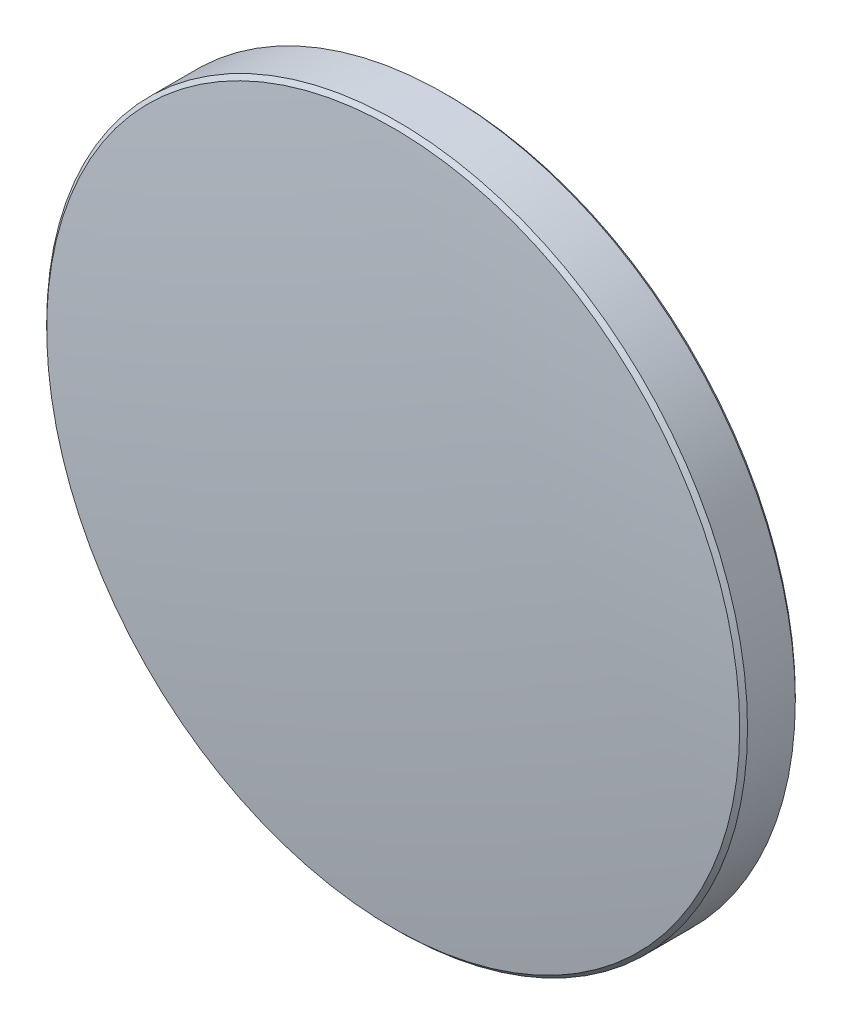
ISO-10303-21;
HEADER;
FILE_DESCRIPTION(('STEP AP214'),'2;1');
FILE_NAME('part.step','',(''),(''),'','','');
FILE_SCHEMA(('AUTOMOTIVE_DESIGN { 1 0 10303 214 1 1 1 1 }'));
ENDSEC;
DATA;
#1=APPLICATION_CONTEXT('core data for automotive mechanical design processes');
#2=APPLICATION_PROTOCOL_DEFINITION('international standard','automotive_design',2000,#1);
#3=PRODUCT_CONTEXT('',#1,'mechanical');
#4=PRODUCT('Part','Part','',(#3));
#5=PRODUCT_RELATED_PRODUCT_CATEGORY('part','',(#4));
#6=PRODUCT_DEFINITION_FORMATION('','',#4);
#7=PRODUCT_DEFINITION_CONTEXT('part definition',#1,'design');
#8=PRODUCT_DEFINITION('design','',#6,#7);
#9=PRODUCT_DEFINITION_SHAPE('','',#8);
#10=(LENGTH_UNIT() NAMED_UNIT(*) SI_UNIT(.MILLI.,.METRE.));
#11=(NAMED_UNIT(*) PLANE_ANGLE_UNIT() SI_UNIT($,.RADIAN.));
#12=(NAMED_UNIT(*) SI_UNIT($,.STERADIAN.) SOLID_ANGLE_UNIT());
#13=UNCERTAINTY_MEASURE_WITH_UNIT(LENGTH_MEASURE(1.E-05),#10,'distance_accuracy_value','');
#14=(GEOMETRIC_REPRESENTATION_CONTEXT(3) GLOBAL_UNCERTAINTY_ASSIGNED_CONTEXT((#13)) GLOBAL_UNIT_ASSIGNED_CONTEXT((#10,
#11,#12)) REPRESENTATION_CONTEXT('',''));
#15=CARTESIAN_POINT('',(0.,0.,0.));
#16=DIRECTION('',(0.,0.,1.));
#17=DIRECTION('',(1.,0.,0.));
#18=AXIS2_PLACEMENT_3D('',#15,#16,#17);
#19=CARTESIAN_POINT('',(0.0296065092348823,0.,-113.669996189596));
#20=DIRECTION('',(0.,-1.,0.));
#21=DIRECTION('',(1.,0.,0.));
#22=AXIS2_PLACEMENT_3D('',#19,#20,#21);
#23=CIRCLE('',#22,115.02);
#24=TRIMMED_CURVE('',#23,(PARAMETER_VALUE(-1.57105372993837)),
(PARAMETER_VALUE(1.57105372993837)),.T.,.PARAMETER.);
#25=CARTESIAN_POINT('',(0.,0.,-113.669996189596));
#26=DIRECTION('',(0.,0.,1.));
#27=AXIS1_PLACEMENT('',#25,#26);
#28=SURFACE_OF_REVOLUTION('',#24,#27);
#29=CARTESIAN_POINT('',(0.,0.,1.35));
#30=VERTEX_POINT('',#29);
#31=VERTEX_LOOP('',#30);
#32=FACE_BOUND('',#31,.T.);
#33=CARTESIAN_POINT('',(0.,0.,0.665585574141439));
#34=DIRECTION('',(0.,0.,1.));
#35=DIRECTION('',(1.,0.,0.));
#36=AXIS2_PLACEMENT_3D('',#33,#34,#35);
#37=CIRCLE('',#36,12.5585786437627);
#38=CARTESIAN_POINT('',(12.5585786437627,0.,0.665585574141439));
#39=VERTEX_POINT('',#38);
#40=EDGE_CURVE('E29',#39,#39,#37,.T.);
#41=ORIENTED_EDGE('',*,*,#40,.T.);
#42=EDGE_LOOP('',(#41));
#43=FACE_BOUND('',#42,.T.);
#44=ADVANCED_FACE('F15',(#32,#43),#28,.T.);
#45=CARTESIAN_POINT('',(0.,0.,-1.35));
#46=DIRECTION('',(0.,0.,1.));
#47=DIRECTION('',(1.,0.,0.));
#48=AXIS2_PLACEMENT_3D('',#45,#46,#47);
#49=PLANE('',#48);
#50=CARTESIAN_POINT('',(0.,0.,-1.35));
#51=DIRECTION('',(0.,0.,1.));
#52=DIRECTION('',(1.,0.,0.));
#53=AXIS2_PLACEMENT_3D('',#50,#51,#52);
#54=CIRCLE('',#53,12.5585786437627);
#55=CARTESIAN_POINT('',(12.5585786437627,0.,-1.35));
#56=VERTEX_POINT('',#55);
#57=EDGE_CURVE('E10',#56,#56,#54,.T.);
#58=ORIENTED_EDGE('',*,*,#57,.F.);
#59=EDGE_LOOP('',(#58));
#60=FACE_BOUND('',#59,.T.);
#61=ADVANCED_FACE('F26',(#60),#49,.F.);
#62=CARTESIAN_POINT('',(0.,0.,-1.35));
#63=DIRECTION('',(0.,0.,1.));
#64=DIRECTION('',(1.,0.,0.));
#65=AXIS2_PLACEMENT_3D('',#62,#63,#64);
#66=CONICAL_SURFACE('',#65,12.5585786437627,0.785398163397454);
#67=CARTESIAN_POINT('',(0.,0.,-1.20857864376269));
#68=DIRECTION('',(0.,0.,1.));
#69=DIRECTION('',(1.,0.,0.));
#70=AXIS2_PLACEMENT_3D('',#67,#68,#69);
#71=CIRCLE('',#70,12.7);
#72=CARTESIAN_POINT('',(12.7,0.,-1.20857864376269));
#73=VERTEX_POINT('',#72);
#74=EDGE_CURVE('E21',#73,#73,#71,.T.);
#75=ORIENTED_EDGE('',*,*,#74,.F.);
#76=EDGE_LOOP('',(#75));
#77=FACE_BOUND('',#76,.T.);
#78=ORIENTED_EDGE('',*,*,#57,.T.);
#79=EDGE_LOOP('',(#78));
#80=FACE_BOUND('',#79,.T.);
#81=ADVANCED_FACE('F40',(#77,#80),#66,.T.);
#82=CARTESIAN_POINT('',(0.,0.,39.5548495293269));
#83=DIRECTION('',(0.,0.,1.));
#84=DIRECTION('',(1.,0.,0.));
#85=AXIS2_PLACEMENT_3D('',#82,#83,#84);
#86=CYLINDRICAL_SURFACE('',#85,12.7);
#87=CARTESIAN_POINT('',(0.,0.,0.524164217904126));
#88=DIRECTION('',(0.,0.,1.));
#89=DIRECTION('',(1.,0.,0.));
#90=AXIS2_PLACEMENT_3D('',#87,#88,#89);
#91=CIRCLE('',#90,12.7);
#92=CARTESIAN_POINT('',(12.7,0.,0.524164217904126));
#93=VERTEX_POINT('',#92);
#94=EDGE_CURVE('E31',#93,#93,#91,.T.);
#95=ORIENTED_EDGE('',*,*,#94,.F.);
#96=EDGE_LOOP('',(#95));
#97=FACE_BOUND('',#96,.T.);
#98=ORIENTED_EDGE('',*,*,#74,.T.);
#99=EDGE_LOOP('',(#98));
#100=FACE_BOUND('',#99,.T.);
#101=ADVANCED_FACE('F38',(#97,#100),#86,.T.);
#102=CARTESIAN_POINT('',(0.,0.,0.524164217904126));
#103=DIRECTION('',(0.,0.,-1.));
#104=DIRECTION('',(-1.,0.,0.));
#105=AXIS2_PLACEMENT_3D('',#102,#103,#104);
#106=CONICAL_SURFACE('',#105,12.7,0.785398163397424);
#107=ORIENTED_EDGE('',*,*,#40,.F.);
#108=EDGE_LOOP('',(#107));
#109=FACE_BOUND('',#108,.T.);
#110=ORIENTED_EDGE('',*,*,#94,.T.);
#111=EDGE_LOOP('',(#110));
#112=FACE_BOUND('',#111,.T.);
#113=ADVANCED_FACE('F54',(#109,#112),#106,.T.);
#114=CLOSED_SHELL('',(#44,#61,#81,#101,#113));
#115=MANIFOLD_SOLID_BREP('B1',#114);
#116=ADVANCED_BREP_SHAPE_REPRESENTATION('',(#18,#115),#14);
#117=SHAPE_DEFINITION_REPRESENTATION(#9,#116);
ENDSEC;
END-ISO-10303-21;
